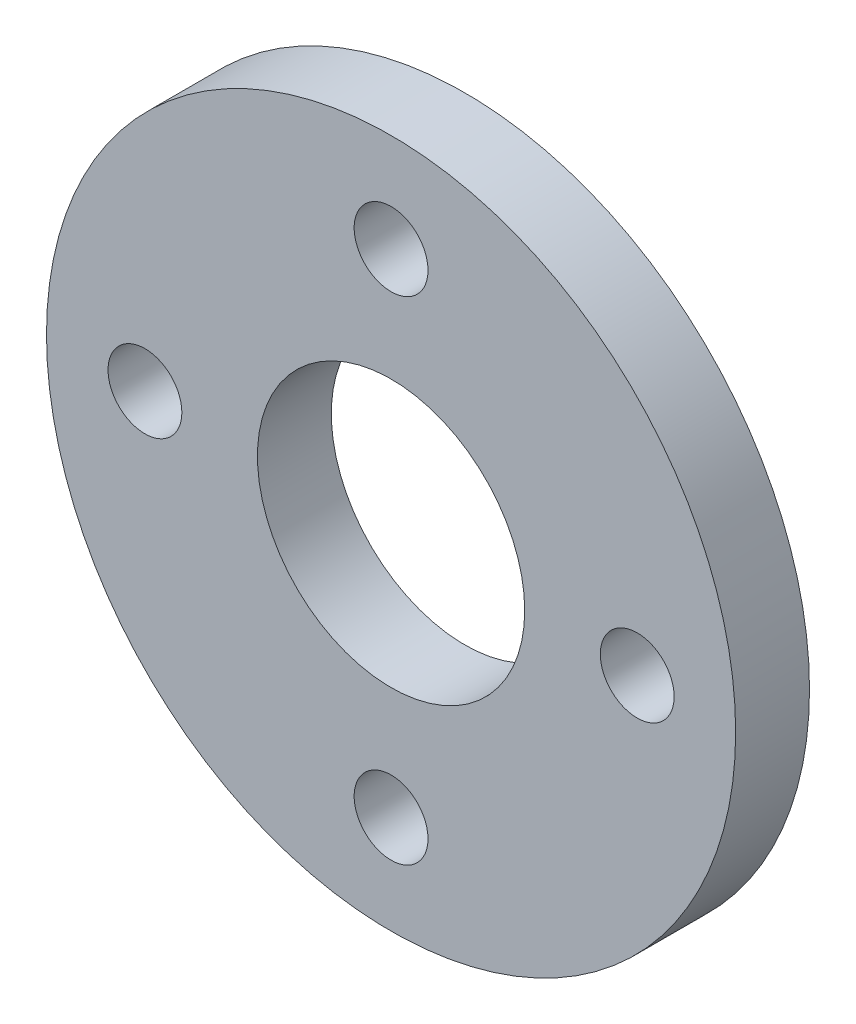
ISO-10303-21;
HEADER;
FILE_DESCRIPTION(('STEP AP214'),'2;1');
FILE_NAME('part.step','',(''),(''),'','','');
FILE_SCHEMA(('AUTOMOTIVE_DESIGN { 1 0 10303 214 1 1 1 1 }'));
ENDSEC;
DATA;
#1=APPLICATION_CONTEXT('core data for automotive mechanical design processes');
#2=APPLICATION_PROTOCOL_DEFINITION('international standard','automotive_design',2000,#1);
#3=PRODUCT_CONTEXT('',#1,'mechanical');
#4=PRODUCT('Part','Part','',(#3));
#5=PRODUCT_RELATED_PRODUCT_CATEGORY('part','',(#4));
#6=PRODUCT_DEFINITION_FORMATION('','',#4);
#7=PRODUCT_DEFINITION_CONTEXT('part definition',#1,'design');
#8=PRODUCT_DEFINITION('design','',#6,#7);
#9=PRODUCT_DEFINITION_SHAPE('','',#8);
#10=(LENGTH_UNIT() NAMED_UNIT(*) SI_UNIT(.MILLI.,.METRE.));
#11=(NAMED_UNIT(*) PLANE_ANGLE_UNIT() SI_UNIT($,.RADIAN.));
#12=(NAMED_UNIT(*) SI_UNIT($,.STERADIAN.) SOLID_ANGLE_UNIT());
#13=UNCERTAINTY_MEASURE_WITH_UNIT(LENGTH_MEASURE(1.E-05),#10,'distance_accuracy_value','');
#14=(GEOMETRIC_REPRESENTATION_CONTEXT(3) GLOBAL_UNCERTAINTY_ASSIGNED_CONTEXT((#13)) GLOBAL_UNIT_ASSIGNED_CONTEXT((#10,
#11,#12)) REPRESENTATION_CONTEXT('',''));
#15=CARTESIAN_POINT('',(0.,0.,0.));
#16=DIRECTION('',(0.,0.,1.));
#17=DIRECTION('',(1.,0.,0.));
#18=AXIS2_PLACEMENT_3D('',#15,#16,#17);
#19=CARTESIAN_POINT('',(0.,0.,76.2));
#20=DIRECTION('',(0.,0.,1.));
#21=DIRECTION('',(1.,0.,0.));
#22=AXIS2_PLACEMENT_3D('',#19,#20,#21);
#23=PLANE('',#22);
#24=CARTESIAN_POINT('',(-1.77367252013231E-12,-254.,76.2));
#25=DIRECTION('',(0.,0.,1.));
#26=DIRECTION('',(1.,0.,0.));
#27=AXIS2_PLACEMENT_3D('',#24,#25,#26);
#28=CIRCLE('',#27,38.1);
#29=CARTESIAN_POINT('',(38.0999999999982,-254.,76.2));
#30=VERTEX_POINT('',#29);
#31=EDGE_CURVE('E65',#30,#30,#28,.T.);
#32=ORIENTED_EDGE('',*,*,#31,.F.);
#33=EDGE_LOOP('',(#32));
#34=FACE_BOUND('',#33,.T.);
#35=CARTESIAN_POINT('',(0.,254.,76.2));
#36=DIRECTION('',(0.,0.,1.));
#37=DIRECTION('',(1.,0.,0.));
#38=AXIS2_PLACEMENT_3D('',#35,#36,#37);
#39=CIRCLE('',#38,38.1);
#40=CARTESIAN_POINT('',(38.1,254.,76.2));
#41=VERTEX_POINT('',#40);
#42=EDGE_CURVE('E53',#41,#41,#39,.T.);
#43=ORIENTED_EDGE('',*,*,#42,.F.);
#44=EDGE_LOOP('',(#43));
#45=FACE_BOUND('',#44,.T.);
#46=CARTESIAN_POINT('',(0.,0.,76.2));
#47=DIRECTION('',(0.,0.,1.));
#48=DIRECTION('',(1.,0.,0.));
#49=AXIS2_PLACEMENT_3D('',#46,#47,#48);
#50=CIRCLE('',#49,355.6);
#51=CARTESIAN_POINT('',(355.6,0.,76.2));
#52=VERTEX_POINT('',#51);
#53=EDGE_CURVE('E10',#52,#52,#50,.T.);
#54=ORIENTED_EDGE('',*,*,#53,.T.);
#55=EDGE_LOOP('',(#54));
#56=FACE_BOUND('',#55,.T.);
#57=CARTESIAN_POINT('',(0.,0.,76.2));
#58=DIRECTION('',(0.,0.,1.));
#59=DIRECTION('',(1.,0.,0.));
#60=AXIS2_PLACEMENT_3D('',#57,#58,#59);
#61=CIRCLE('',#60,137.912831168311);
#62=CARTESIAN_POINT('',(137.912831168311,0.,76.2));
#63=VERTEX_POINT('',#62);
#64=EDGE_CURVE('E48',#63,#63,#61,.T.);
#65=ORIENTED_EDGE('',*,*,#64,.F.);
#66=EDGE_LOOP('',(#65));
#67=FACE_BOUND('',#66,.T.);
#68=CARTESIAN_POINT('',(254.,-8.86836260066156E-13,76.2));
#69=DIRECTION('',(0.,0.,1.));
#70=DIRECTION('',(1.,0.,0.));
#71=AXIS2_PLACEMENT_3D('',#68,#69,#70);
#72=CIRCLE('',#71,38.1);
#73=CARTESIAN_POINT('',(292.1,-8.86836260066156E-13,76.2));
#74=VERTEX_POINT('',#73);
#75=EDGE_CURVE('E59',#74,#74,#72,.T.);
#76=ORIENTED_EDGE('',*,*,#75,.F.);
#77=EDGE_LOOP('',(#76));
#78=FACE_BOUND('',#77,.T.);
#79=CARTESIAN_POINT('',(-254.,2.66050878019847E-12,76.2));
#80=DIRECTION('',(0.,0.,1.));
#81=DIRECTION('',(1.,0.,0.));
#82=AXIS2_PLACEMENT_3D('',#79,#80,#81);
#83=CIRCLE('',#82,38.1);
#84=CARTESIAN_POINT('',(-215.9,2.66050878019847E-12,76.2));
#85=VERTEX_POINT('',#84);
#86=EDGE_CURVE('E71',#85,#85,#83,.T.);
#87=ORIENTED_EDGE('',*,*,#86,.F.);
#88=EDGE_LOOP('',(#87));
#89=FACE_BOUND('',#88,.T.);
#90=ADVANCED_FACE('F37',(#34,#45,#56,#67,#78,#89),#23,.T.);
#91=CARTESIAN_POINT('',(0.,0.,0.));
#92=DIRECTION('',(0.,0.,1.));
#93=DIRECTION('',(1.,0.,0.));
#94=AXIS2_PLACEMENT_3D('',#91,#92,#93);
#95=PLANE('',#94);
#96=CARTESIAN_POINT('',(0.,0.,0.));
#97=DIRECTION('',(0.,0.,1.));
#98=DIRECTION('',(1.,0.,0.));
#99=AXIS2_PLACEMENT_3D('',#96,#97,#98);
#100=CIRCLE('',#99,355.6);
#101=CARTESIAN_POINT('',(355.6,0.,0.));
#102=VERTEX_POINT('',#101);
#103=EDGE_CURVE('E41',#102,#102,#100,.T.);
#104=ORIENTED_EDGE('',*,*,#103,.F.);
#105=EDGE_LOOP('',(#104));
#106=FACE_BOUND('',#105,.T.);
#107=CARTESIAN_POINT('',(0.,0.,0.));
#108=DIRECTION('',(0.,0.,1.));
#109=DIRECTION('',(1.,0.,0.));
#110=AXIS2_PLACEMENT_3D('',#107,#108,#109);
#111=CIRCLE('',#110,137.912831168311);
#112=CARTESIAN_POINT('',(137.912831168311,0.,0.));
#113=VERTEX_POINT('',#112);
#114=EDGE_CURVE('E50',#113,#113,#111,.T.);
#115=ORIENTED_EDGE('',*,*,#114,.T.);
#116=EDGE_LOOP('',(#115));
#117=FACE_BOUND('',#116,.T.);
#118=CARTESIAN_POINT('',(0.,254.,0.));
#119=DIRECTION('',(0.,0.,1.));
#120=DIRECTION('',(1.,0.,0.));
#121=AXIS2_PLACEMENT_3D('',#118,#119,#120);
#122=CIRCLE('',#121,38.1);
#123=CARTESIAN_POINT('',(38.1,254.,0.));
#124=VERTEX_POINT('',#123);
#125=EDGE_CURVE('E56',#124,#124,#122,.T.);
#126=ORIENTED_EDGE('',*,*,#125,.T.);
#127=EDGE_LOOP('',(#126));
#128=FACE_BOUND('',#127,.T.);
#129=CARTESIAN_POINT('',(254.,-8.86836260066156E-13,0.));
#130=DIRECTION('',(0.,0.,1.));
#131=DIRECTION('',(1.,0.,0.));
#132=AXIS2_PLACEMENT_3D('',#129,#130,#131);
#133=CIRCLE('',#132,38.1);
#134=CARTESIAN_POINT('',(292.1,-8.86836260066156E-13,0.));
#135=VERTEX_POINT('',#134);
#136=EDGE_CURVE('E62',#135,#135,#133,.T.);
#137=ORIENTED_EDGE('',*,*,#136,.T.);
#138=EDGE_LOOP('',(#137));
#139=FACE_BOUND('',#138,.T.);
#140=CARTESIAN_POINT('',(-1.77367252013231E-12,-254.,0.));
#141=DIRECTION('',(0.,0.,1.));
#142=DIRECTION('',(1.,0.,0.));
#143=AXIS2_PLACEMENT_3D('',#140,#141,#142);
#144=CIRCLE('',#143,38.1);
#145=CARTESIAN_POINT('',(38.0999999999982,-254.,0.));
#146=VERTEX_POINT('',#145);
#147=EDGE_CURVE('E68',#146,#146,#144,.T.);
#148=ORIENTED_EDGE('',*,*,#147,.T.);
#149=EDGE_LOOP('',(#148));
#150=FACE_BOUND('',#149,.T.);
#151=CARTESIAN_POINT('',(-254.,2.66050878019847E-12,0.));
#152=DIRECTION('',(0.,0.,1.));
#153=DIRECTION('',(1.,0.,0.));
#154=AXIS2_PLACEMENT_3D('',#151,#152,#153);
#155=CIRCLE('',#154,38.1);
#156=CARTESIAN_POINT('',(-215.9,2.66050878019847E-12,0.));
#157=VERTEX_POINT('',#156);
#158=EDGE_CURVE('E74',#157,#157,#155,.T.);
#159=ORIENTED_EDGE('',*,*,#158,.T.);
#160=EDGE_LOOP('',(#159));
#161=FACE_BOUND('',#160,.T.);
#162=ADVANCED_FACE('F84',(#106,#117,#128,#139,#150,#161),#95,.F.);
#163=CARTESIAN_POINT('',(0.,0.,76.2));
#164=DIRECTION('',(0.,0.,-1.));
#165=DIRECTION('',(-1.,0.,0.));
#166=AXIS2_PLACEMENT_3D('',#163,#164,#165);
#167=CYLINDRICAL_SURFACE('',#166,355.6);
#168=ORIENTED_EDGE('',*,*,#53,.F.);
#169=EDGE_LOOP('',(#168));
#170=FACE_BOUND('',#169,.T.);
#171=ORIENTED_EDGE('',*,*,#103,.T.);
#172=EDGE_LOOP('',(#171));
#173=FACE_BOUND('',#172,.T.);
#174=ADVANCED_FACE('F39',(#170,#173),#167,.T.);
#175=CARTESIAN_POINT('',(0.,0.,76.2));
#176=DIRECTION('',(0.,0.,-1.));
#177=DIRECTION('',(-1.,0.,0.));
#178=AXIS2_PLACEMENT_3D('',#175,#176,#177);
#179=CYLINDRICAL_SURFACE('',#178,137.912831168311);
#180=ORIENTED_EDGE('',*,*,#64,.T.);
#181=EDGE_LOOP('',(#180));
#182=FACE_BOUND('',#181,.T.);
#183=ORIENTED_EDGE('',*,*,#114,.F.);
#184=EDGE_LOOP('',(#183));
#185=FACE_BOUND('',#184,.T.);
#186=ADVANCED_FACE('F94',(#182,#185),#179,.F.);
#187=CARTESIAN_POINT('',(0.,254.,76.2));
#188=DIRECTION('',(0.,0.,-1.));
#189=DIRECTION('',(-1.,0.,0.));
#190=AXIS2_PLACEMENT_3D('',#187,#188,#189);
#191=CYLINDRICAL_SURFACE('',#190,38.1);
#192=ORIENTED_EDGE('',*,*,#42,.T.);
#193=EDGE_LOOP('',(#192));
#194=FACE_BOUND('',#193,.T.);
#195=ORIENTED_EDGE('',*,*,#125,.F.);
#196=EDGE_LOOP('',(#195));
#197=FACE_BOUND('',#196,.T.);
#198=ADVANCED_FACE('F97',(#194,#197),#191,.F.);
#199=CARTESIAN_POINT('',(254.,-8.86836260066156E-13,76.2));
#200=DIRECTION('',(0.,0.,-1.));
#201=DIRECTION('',(-1.,0.,0.));
#202=AXIS2_PLACEMENT_3D('',#199,#200,#201);
#203=CYLINDRICAL_SURFACE('',#202,38.1);
#204=ORIENTED_EDGE('',*,*,#75,.T.);
#205=EDGE_LOOP('',(#204));
#206=FACE_BOUND('',#205,.T.);
#207=ORIENTED_EDGE('',*,*,#136,.F.);
#208=EDGE_LOOP('',(#207));
#209=FACE_BOUND('',#208,.T.);
#210=ADVANCED_FACE('F101',(#206,#209),#203,.F.);
#211=CARTESIAN_POINT('',(-1.77367252013231E-12,-254.,76.2));
#212=DIRECTION('',(0.,0.,-1.));
#213=DIRECTION('',(-1.,0.,0.));
#214=AXIS2_PLACEMENT_3D('',#211,#212,#213);
#215=CYLINDRICAL_SURFACE('',#214,38.1);
#216=ORIENTED_EDGE('',*,*,#31,.T.);
#217=EDGE_LOOP('',(#216));
#218=FACE_BOUND('',#217,.T.);
#219=ORIENTED_EDGE('',*,*,#147,.F.);
#220=EDGE_LOOP('',(#219));
#221=FACE_BOUND('',#220,.T.);
#222=ADVANCED_FACE('F105',(#218,#221),#215,.F.);
#223=CARTESIAN_POINT('',(-254.,2.66050878019847E-12,76.2));
#224=DIRECTION('',(0.,0.,-1.));
#225=DIRECTION('',(-1.,0.,0.));
#226=AXIS2_PLACEMENT_3D('',#223,#224,#225);
#227=CYLINDRICAL_SURFACE('',#226,38.1);
#228=ORIENTED_EDGE('',*,*,#86,.T.);
#229=EDGE_LOOP('',(#228));
#230=FACE_BOUND('',#229,.T.);
#231=ORIENTED_EDGE('',*,*,#158,.F.);
#232=EDGE_LOOP('',(#231));
#233=FACE_BOUND('',#232,.T.);
#234=ADVANCED_FACE('F80',(#230,#233),#227,.F.);
#235=CLOSED_SHELL('',(#90,#162,#174,#186,#198,#210,#222,#234));
#236=MANIFOLD_SOLID_BREP('B2',#235);
#237=ADVANCED_BREP_SHAPE_REPRESENTATION('',(#18,#236),#14);
#238=SHAPE_DEFINITION_REPRESENTATION(#9,#237);
ENDSEC;
END-ISO-10303-21;
